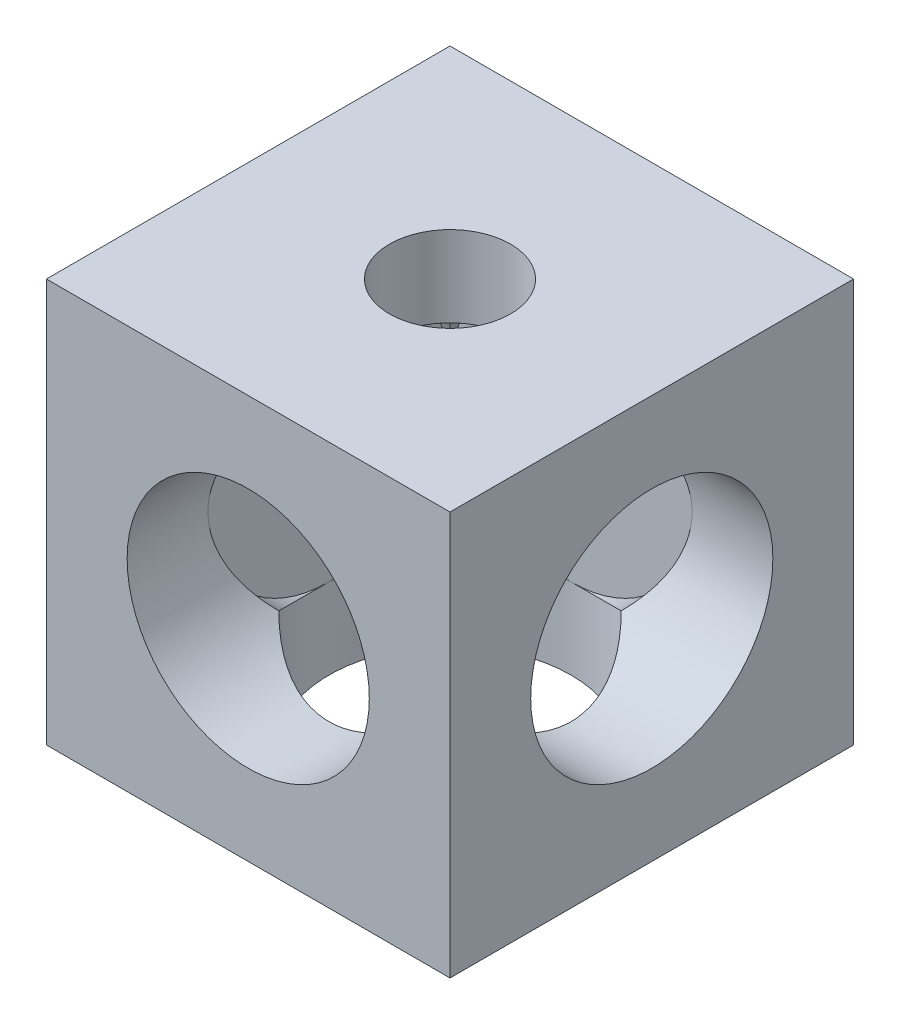
ISO-10303-21;
HEADER;
FILE_DESCRIPTION(('STEP AP214'),'2;1');
FILE_NAME('part.step','',(''),(''),'','','');
FILE_SCHEMA(('AUTOMOTIVE_DESIGN { 1 0 10303 214 1 1 1 1 }'));
ENDSEC;
DATA;
#1=APPLICATION_CONTEXT('core data for automotive mechanical design processes');
#2=APPLICATION_PROTOCOL_DEFINITION('international standard','automotive_design',2000,#1);
#3=PRODUCT_CONTEXT('',#1,'mechanical');
#4=PRODUCT('Part','Part','',(#3));
#5=PRODUCT_RELATED_PRODUCT_CATEGORY('part','',(#4));
#6=PRODUCT_DEFINITION_FORMATION('','',#4);
#7=PRODUCT_DEFINITION_CONTEXT('part definition',#1,'design');
#8=PRODUCT_DEFINITION('design','',#6,#7);
#9=PRODUCT_DEFINITION_SHAPE('','',#8);
#10=(LENGTH_UNIT() NAMED_UNIT(*) SI_UNIT(.MILLI.,.METRE.));
#11=(NAMED_UNIT(*) PLANE_ANGLE_UNIT() SI_UNIT($,.RADIAN.));
#12=(NAMED_UNIT(*) SI_UNIT($,.STERADIAN.) SOLID_ANGLE_UNIT());
#13=UNCERTAINTY_MEASURE_WITH_UNIT(LENGTH_MEASURE(1.E-05),#10,'distance_accuracy_value','');
#14=(GEOMETRIC_REPRESENTATION_CONTEXT(3) GLOBAL_UNCERTAINTY_ASSIGNED_CONTEXT((#13)) GLOBAL_UNIT_ASSIGNED_CONTEXT((#10,
#11,#12)) REPRESENTATION_CONTEXT('',''));
#15=CARTESIAN_POINT('',(0.,0.,0.));
#16=DIRECTION('',(0.,0.,1.));
#17=DIRECTION('',(1.,0.,0.));
#18=AXIS2_PLACEMENT_3D('',#15,#16,#17);
#19=CARTESIAN_POINT('',(5.,5.,2.));
#20=DIRECTION('',(0.,0.,1.));
#21=DIRECTION('',(1.,0.,0.));
#22=AXIS2_PLACEMENT_3D('',#19,#20,#21);
#23=CYLINDRICAL_SURFACE('',#22,3.);
#24=CARTESIAN_POINT('',(5.,5.,2.));
#25=DIRECTION('',(0.,0.,1.));
#26=DIRECTION('',(1.,0.,0.));
#27=AXIS2_PLACEMENT_3D('',#24,#25,#26);
#28=CIRCLE('',#27,3.);
#29=CARTESIAN_POINT('',(5.,8.,2.));
#30=VERTEX_POINT('',#29);
#31=CARTESIAN_POINT('',(2.00000000000001,5.,2.));
#32=VERTEX_POINT('',#31);
#33=EDGE_CURVE('E164',#30,#32,#28,.T.);
#34=ORIENTED_EDGE('',*,*,#33,.F.);
#35=CARTESIAN_POINT('',(5.,5.,5.));
#36=DIRECTION('',(0.,0.707106781186547,0.707106781186547));
#37=DIRECTION('',(0.,-0.707106781186547,0.707106781186547));
#38=AXIS2_PLACEMENT_3D('',#35,#36,#37);
#39=ELLIPSE('',#38,4.24264068711928,3.);
#40=CARTESIAN_POINT('',(2.87867965644036,7.12132034355965,2.87867965644036));
#41=VERTEX_POINT('',#40);
#42=EDGE_CURVE('E127',#30,#41,#39,.T.);
#43=ORIENTED_EDGE('',*,*,#42,.T.);
#44=CARTESIAN_POINT('',(5.,5.,5.));
#45=DIRECTION('',(-0.707106781186547,0.,0.707106781186547));
#46=DIRECTION('',(0.707106781186547,0.,0.707106781186547));
#47=AXIS2_PLACEMENT_3D('',#44,#45,#46);
#48=ELLIPSE('',#47,4.24264068711928,3.);
#49=EDGE_CURVE('E165',#41,#32,#48,.T.);
#50=ORIENTED_EDGE('',*,*,#49,.T.);
#51=EDGE_LOOP('',(#34,#43,#50));
#52=FACE_BOUND('',#51,.T.);
#53=ADVANCED_FACE('F33',(#52),#23,.F.);
#54=CARTESIAN_POINT('',(2.87867965644036,2.87867965644036,2.87867965644036));
#55=VERTEX_POINT('',#54);
#56=EDGE_CURVE('E226',#32,#55,#48,.T.);
#57=ORIENTED_EDGE('',*,*,#56,.T.);
#58=CARTESIAN_POINT('',(5.,5.,5.));
#59=DIRECTION('',(0.,-0.707106781186547,0.707106781186547));
#60=DIRECTION('',(0.,0.707106781186547,0.707106781186547));
#61=AXIS2_PLACEMENT_3D('',#58,#59,#60);
#62=ELLIPSE('',#61,4.24264068711928,3.);
#63=CARTESIAN_POINT('',(5.,2.00000000000001,2.));
#64=VERTEX_POINT('',#63);
#65=EDGE_CURVE('E293',#55,#64,#62,.T.);
#66=ORIENTED_EDGE('',*,*,#65,.T.);
#67=EDGE_CURVE('E170',#32,#64,#28,.T.);
#68=ORIENTED_EDGE('',*,*,#67,.F.);
#69=EDGE_LOOP('',(#57,#66,#68));
#70=FACE_BOUND('',#69,.T.);
#71=ADVANCED_FACE('F292',(#70),#23,.F.);
#72=CARTESIAN_POINT('',(2.00000000000001,5.,5.));
#73=DIRECTION('',(1.,0.,0.));
#74=DIRECTION('',(0.,0.,-1.));
#75=AXIS2_PLACEMENT_3D('',#72,#73,#74);
#76=CYLINDRICAL_SURFACE('',#75,3.);
#77=CARTESIAN_POINT('',(5.,5.,5.));
#78=DIRECTION('',(0.707106781186547,0.,0.707106781186547));
#79=DIRECTION('',(-0.707106781186547,0.,0.707106781186547));
#80=AXIS2_PLACEMENT_3D('',#77,#78,#79);
#81=ELLIPSE('',#80,4.24264068711928,3.);
#82=CARTESIAN_POINT('',(2.87867965644036,2.87867965644036,7.12132034355964));
#83=VERTEX_POINT('',#82);
#84=CARTESIAN_POINT('',(2.00000000000001,5.,8.));
#85=VERTEX_POINT('',#84);
#86=EDGE_CURVE('E234',#83,#85,#81,.F.);
#87=ORIENTED_EDGE('',*,*,#86,.F.);
#88=CARTESIAN_POINT('',(5.,5.,5.));
#89=DIRECTION('',(0.707106781186547,-0.707106781186547,0.));
#90=DIRECTION('',(0.707106781186547,0.707106781186547,0.));
#91=AXIS2_PLACEMENT_3D('',#88,#89,#90);
#92=ELLIPSE('',#91,4.24264068711928,3.);
#93=CARTESIAN_POINT('',(2.00000000000001,2.,5.));
#94=VERTEX_POINT('',#93);
#95=EDGE_CURVE('E252',#83,#94,#92,.T.);
#96=ORIENTED_EDGE('',*,*,#95,.T.);
#97=CARTESIAN_POINT('',(2.00000000000001,5.,5.));
#98=DIRECTION('',(1.,0.,0.));
#99=DIRECTION('',(0.,0.,-1.));
#100=AXIS2_PLACEMENT_3D('',#97,#98,#99);
#101=CIRCLE('',#100,3.);
#102=EDGE_CURVE('E268',#85,#94,#101,.T.);
#103=ORIENTED_EDGE('',*,*,#102,.F.);
#104=EDGE_LOOP('',(#87,#96,#103));
#105=FACE_BOUND('',#104,.T.);
#106=ADVANCED_FACE('F284',(#105),#76,.F.);
#107=CARTESIAN_POINT('',(2.,8.,5.));
#108=VERTEX_POINT('',#107);
#109=EDGE_CURVE('E266',#108,#85,#101,.T.);
#110=ORIENTED_EDGE('',*,*,#109,.F.);
#111=CARTESIAN_POINT('',(5.,5.,5.));
#112=DIRECTION('',(0.707106781186547,0.707106781186547,0.));
#113=DIRECTION('',(0.707106781186547,-0.707106781186547,0.));
#114=AXIS2_PLACEMENT_3D('',#111,#112,#113);
#115=ELLIPSE('',#114,4.24264068711928,3.);
#116=CARTESIAN_POINT('',(2.87867965644036,7.12132034355965,7.12132034355964));
#117=VERTEX_POINT('',#116);
#118=EDGE_CURVE('E162',#108,#117,#115,.T.);
#119=ORIENTED_EDGE('',*,*,#118,.T.);
#120=EDGE_CURVE('E231',#85,#117,#81,.F.);
#121=ORIENTED_EDGE('',*,*,#120,.F.);
#122=EDGE_LOOP('',(#110,#119,#121));
#123=FACE_BOUND('',#122,.T.);
#124=ADVANCED_FACE('F282',(#123),#76,.F.);
#125=CARTESIAN_POINT('',(5.,10.,5.));
#126=DIRECTION('',(0.,-1.,0.));
#127=DIRECTION('',(0.,0.,-1.));
#128=AXIS2_PLACEMENT_3D('',#125,#126,#127);
#129=CYLINDRICAL_SURFACE('',#128,1.5);
#130=CARTESIAN_POINT('',(5.,10.,5.));
#131=DIRECTION('',(0.,-1.,0.));
#132=DIRECTION('',(0.,0.,-1.));
#133=AXIS2_PLACEMENT_3D('',#130,#131,#132);
#134=CIRCLE('',#133,1.5);
#135=CARTESIAN_POINT('',(5.,10.,3.5));
#136=VERTEX_POINT('',#135);
#137=EDGE_CURVE('E138',#136,#136,#134,.T.);
#138=ORIENTED_EDGE('',*,*,#137,.F.);
#139=EDGE_LOOP('',(#138));
#140=FACE_BOUND('',#139,.T.);
#141=CARTESIAN_POINT('',(5.,8.,5.));
#142=DIRECTION('',(0.,-1.,0.));
#143=DIRECTION('',(0.,0.,-1.));
#144=AXIS2_PLACEMENT_3D('',#141,#142,#143);
#145=CIRCLE('',#144,1.5);
#146=CARTESIAN_POINT('',(5.,8.,3.5));
#147=VERTEX_POINT('',#146);
#148=EDGE_CURVE('E238',#147,#147,#145,.F.);
#149=ORIENTED_EDGE('',*,*,#148,.F.);
#150=EDGE_LOOP('',(#149));
#151=FACE_BOUND('',#150,.T.);
#152=ADVANCED_FACE('F360',(#140,#151),#129,.F.);
#153=CARTESIAN_POINT('',(5.,5.,5.));
#154=DIRECTION('',(0.707106781186547,0.,0.707106781186547));
#155=DIRECTION('',(-0.707106781186547,0.,0.707106781186547));
#156=AXIS2_PLACEMENT_3D('',#153,#154,#155);
#157=ELLIPSE('',#156,4.24264068711928,3.);
#158=CARTESIAN_POINT('',(8.,5.,2.));
#159=VERTEX_POINT('',#158);
#160=CARTESIAN_POINT('',(7.12132034355965,7.12132034355965,2.87867965644036));
#161=VERTEX_POINT('',#160);
#162=EDGE_CURVE('E161',#159,#161,#157,.T.);
#163=ORIENTED_EDGE('',*,*,#162,.T.);
#164=EDGE_CURVE('E49',#161,#30,#39,.T.);
#165=ORIENTED_EDGE('',*,*,#164,.T.);
#166=EDGE_CURVE('E159',#159,#30,#28,.T.);
#167=ORIENTED_EDGE('',*,*,#166,.F.);
#168=EDGE_LOOP('',(#163,#165,#167));
#169=FACE_BOUND('',#168,.T.);
#170=ADVANCED_FACE('F157',(#169),#23,.F.);
#171=CARTESIAN_POINT('',(5.,5.,10.));
#172=DIRECTION('',(0.,0.,1.));
#173=DIRECTION('',(1.,0.,0.));
#174=AXIS2_PLACEMENT_3D('',#171,#172,#173);
#175=CIRCLE('',#174,3.);
#176=CARTESIAN_POINT('',(8.,5.,10.));
#177=VERTEX_POINT('',#176);
#178=EDGE_CURVE('E183',#177,#177,#175,.T.);
#179=ORIENTED_EDGE('',*,*,#178,.T.);
#180=EDGE_LOOP('',(#179));
#181=FACE_BOUND('',#180,.T.);
#182=ORIENTED_EDGE('',*,*,#120,.T.);
#183=CARTESIAN_POINT('',(5.,5.,5.));
#184=DIRECTION('',(0.,-0.707106781186547,0.707106781186547));
#185=DIRECTION('',(0.,0.707106781186547,0.707106781186547));
#186=AXIS2_PLACEMENT_3D('',#183,#184,#185);
#187=ELLIPSE('',#186,4.24264068711928,3.);
#188=CARTESIAN_POINT('',(5.,8.,8.));
#189=VERTEX_POINT('',#188);
#190=EDGE_CURVE('E163',#117,#189,#187,.F.);
#191=ORIENTED_EDGE('',*,*,#190,.T.);
#192=CARTESIAN_POINT('',(7.12132034355965,7.12132034355965,7.12132034355964));
#193=VERTEX_POINT('',#192);
#194=EDGE_CURVE('E250',#189,#193,#187,.F.);
#195=ORIENTED_EDGE('',*,*,#194,.T.);
#196=CARTESIAN_POINT('',(5.,5.,5.));
#197=DIRECTION('',(-0.707106781186547,0.,0.707106781186547));
#198=DIRECTION('',(0.707106781186547,0.,0.707106781186547));
#199=AXIS2_PLACEMENT_3D('',#196,#197,#198);
#200=ELLIPSE('',#199,4.24264068711928,3.);
#201=CARTESIAN_POINT('',(7.12132034355965,2.87867965644036,7.12132034355964));
#202=VERTEX_POINT('',#201);
#203=EDGE_CURVE('E235',#193,#202,#200,.F.);
#204=ORIENTED_EDGE('',*,*,#203,.T.);
#205=CARTESIAN_POINT('',(5.,5.,5.));
#206=DIRECTION('',(0.,0.707106781186547,0.707106781186547));
#207=DIRECTION('',(0.,-0.707106781186547,0.707106781186547));
#208=AXIS2_PLACEMENT_3D('',#205,#206,#207);
#209=ELLIPSE('',#208,4.24264068711928,3.);
#210=EDGE_CURVE('E57',#202,#83,#209,.F.);
#211=ORIENTED_EDGE('',*,*,#210,.T.);
#212=ORIENTED_EDGE('',*,*,#86,.T.);
#213=EDGE_LOOP('',(#182,#191,#195,#204,#211,#212));
#214=FACE_BOUND('',#213,.T.);
#215=ADVANCED_FACE('F247',(#181,#214),#23,.F.);
#216=CARTESIAN_POINT('',(0.,5.,5.));
#217=DIRECTION('',(1.,0.,0.));
#218=DIRECTION('',(0.,0.,-1.));
#219=AXIS2_PLACEMENT_3D('',#216,#217,#218);
#220=CYLINDRICAL_SURFACE('',#219,1.5);
#221=CARTESIAN_POINT('',(0.,5.,5.));
#222=DIRECTION('',(1.,0.,0.));
#223=DIRECTION('',(0.,0.,-1.));
#224=AXIS2_PLACEMENT_3D('',#221,#222,#223);
#225=CIRCLE('',#224,1.5);
#226=CARTESIAN_POINT('',(0.,5.,3.5));
#227=VERTEX_POINT('',#226);
#228=EDGE_CURVE('E185',#227,#227,#225,.T.);
#229=ORIENTED_EDGE('',*,*,#228,.F.);
#230=EDGE_LOOP('',(#229));
#231=FACE_BOUND('',#230,.T.);
#232=CARTESIAN_POINT('',(2.00000000000001,5.,5.));
#233=DIRECTION('',(1.,0.,0.));
#234=DIRECTION('',(0.,0.,-1.));
#235=AXIS2_PLACEMENT_3D('',#232,#233,#234);
#236=CIRCLE('',#235,1.5);
#237=CARTESIAN_POINT('',(2.00000000000001,5.,3.5));
#238=VERTEX_POINT('',#237);
#239=EDGE_CURVE('E222',#238,#238,#236,.F.);
#240=ORIENTED_EDGE('',*,*,#239,.F.);
#241=EDGE_LOOP('',(#240));
#242=FACE_BOUND('',#241,.T.);
#243=ADVANCED_FACE('F352',(#231,#242),#220,.F.);
#244=CARTESIAN_POINT('',(5.,5.,0.));
#245=DIRECTION('',(0.,0.,1.));
#246=DIRECTION('',(1.,0.,0.));
#247=AXIS2_PLACEMENT_3D('',#244,#245,#246);
#248=CYLINDRICAL_SURFACE('',#247,1.5);
#249=CARTESIAN_POINT('',(5.,5.,0.));
#250=DIRECTION('',(0.,0.,1.));
#251=DIRECTION('',(1.,0.,0.));
#252=AXIS2_PLACEMENT_3D('',#249,#250,#251);
#253=CIRCLE('',#252,1.5);
#254=CARTESIAN_POINT('',(6.5,5.,0.));
#255=VERTEX_POINT('',#254);
#256=EDGE_CURVE('E178',#255,#255,#253,.T.);
#257=ORIENTED_EDGE('',*,*,#256,.F.);
#258=EDGE_LOOP('',(#257));
#259=FACE_BOUND('',#258,.T.);
#260=CARTESIAN_POINT('',(5.,5.,2.));
#261=DIRECTION('',(0.,0.,1.));
#262=DIRECTION('',(1.,0.,0.));
#263=AXIS2_PLACEMENT_3D('',#260,#261,#262);
#264=CIRCLE('',#263,1.5);
#265=CARTESIAN_POINT('',(6.5,5.,2.));
#266=VERTEX_POINT('',#265);
#267=EDGE_CURVE('E176',#266,#266,#264,.F.);
#268=ORIENTED_EDGE('',*,*,#267,.F.);
#269=EDGE_LOOP('',(#268));
#270=FACE_BOUND('',#269,.T.);
#271=ADVANCED_FACE('F357',(#259,#270),#248,.F.);
#272=CARTESIAN_POINT('',(0.,0.,10.));
#273=DIRECTION('',(1.,0.,0.));
#274=DIRECTION('',(0.,0.,-1.));
#275=AXIS2_PLACEMENT_3D('',#272,#273,#274);
#276=PLANE('',#275);
#277=ORIENTED_EDGE('',*,*,#228,.T.);
#278=EDGE_LOOP('',(#277));
#279=FACE_BOUND('',#278,.T.);
#280=DIRECTION('',(0.,-1.,0.));
#281=VECTOR('',#280,1.);
#282=CARTESIAN_POINT('',(0.,0.,0.));
#283=LINE('',#282,#281);
#284=CARTESIAN_POINT('',(0.,10.,0.));
#285=VERTEX_POINT('',#284);
#286=CARTESIAN_POINT('',(0.,0.,0.));
#287=VERTEX_POINT('',#286);
#288=EDGE_CURVE('E193',#285,#287,#283,.T.);
#289=ORIENTED_EDGE('',*,*,#288,.T.);
#290=DIRECTION('',(0.,0.,-1.));
#291=VECTOR('',#290,1.);
#292=CARTESIAN_POINT('',(0.,0.,10.));
#293=LINE('',#292,#291);
#294=CARTESIAN_POINT('',(0.,0.,10.));
#295=VERTEX_POINT('',#294);
#296=EDGE_CURVE('E220',#295,#287,#293,.T.);
#297=ORIENTED_EDGE('',*,*,#296,.F.);
#298=DIRECTION('',(0.,-1.,0.));
#299=VECTOR('',#298,1.);
#300=CARTESIAN_POINT('',(0.,0.,10.));
#301=LINE('',#300,#299);
#302=CARTESIAN_POINT('',(0.,10.,10.));
#303=VERTEX_POINT('',#302);
#304=EDGE_CURVE('E194',#303,#295,#301,.T.);
#305=ORIENTED_EDGE('',*,*,#304,.F.);
#306=DIRECTION('',(0.,0.,-1.));
#307=VECTOR('',#306,1.);
#308=CARTESIAN_POINT('',(0.,10.,10.));
#309=LINE('',#308,#307);
#310=EDGE_CURVE('E204',#303,#285,#309,.T.);
#311=ORIENTED_EDGE('',*,*,#310,.T.);
#312=EDGE_LOOP('',(#289,#297,#305,#311));
#313=FACE_BOUND('',#312,.T.);
#314=ADVANCED_FACE('F35',(#279,#313),#276,.F.);
#315=CARTESIAN_POINT('',(0.,0.,10.));
#316=DIRECTION('',(0.,1.,0.));
#317=DIRECTION('',(0.,0.,1.));
#318=AXIS2_PLACEMENT_3D('',#315,#316,#317);
#319=PLANE('',#318);
#320=CARTESIAN_POINT('',(5.,0.,5.));
#321=DIRECTION('',(0.,-1.,0.));
#322=DIRECTION('',(0.,0.,-1.));
#323=AXIS2_PLACEMENT_3D('',#320,#321,#322);
#324=CIRCLE('',#323,3.);
#325=CARTESIAN_POINT('',(5.,0.,2.));
#326=VERTEX_POINT('',#325);
#327=EDGE_CURVE('E148',#326,#326,#324,.T.);
#328=ORIENTED_EDGE('',*,*,#327,.F.);
#329=EDGE_LOOP('',(#328));
#330=FACE_BOUND('',#329,.T.);
#331=DIRECTION('',(1.,0.,0.));
#332=VECTOR('',#331,1.);
#333=CARTESIAN_POINT('',(0.,0.,0.));
#334=LINE('',#333,#332);
#335=CARTESIAN_POINT('',(10.,0.,0.));
#336=VERTEX_POINT('',#335);
#337=EDGE_CURVE('E207',#287,#336,#334,.T.);
#338=ORIENTED_EDGE('',*,*,#337,.T.);
#339=DIRECTION('',(0.,0.,-1.));
#340=VECTOR('',#339,1.);
#341=CARTESIAN_POINT('',(10.,0.,10.));
#342=LINE('',#341,#340);
#343=CARTESIAN_POINT('',(10.,0.,10.));
#344=VERTEX_POINT('',#343);
#345=EDGE_CURVE('E217',#344,#336,#342,.T.);
#346=ORIENTED_EDGE('',*,*,#345,.F.);
#347=DIRECTION('',(1.,0.,0.));
#348=VECTOR('',#347,1.);
#349=CARTESIAN_POINT('',(0.,0.,10.));
#350=LINE('',#349,#348);
#351=EDGE_CURVE('E197',#295,#344,#350,.T.);
#352=ORIENTED_EDGE('',*,*,#351,.F.);
#353=ORIENTED_EDGE('',*,*,#296,.T.);
#354=EDGE_LOOP('',(#338,#346,#352,#353));
#355=FACE_BOUND('',#354,.T.);
#356=ADVANCED_FACE('F303',(#330,#355),#319,.F.);
#357=CARTESIAN_POINT('',(10.,0.,10.));
#358=DIRECTION('',(-1.,0.,0.));
#359=DIRECTION('',(0.,0.,1.));
#360=AXIS2_PLACEMENT_3D('',#357,#358,#359);
#361=PLANE('',#360);
#362=CARTESIAN_POINT('',(10.,5.,5.));
#363=DIRECTION('',(1.,0.,0.));
#364=DIRECTION('',(0.,0.,-1.));
#365=AXIS2_PLACEMENT_3D('',#362,#363,#364);
#366=CIRCLE('',#365,3.);
#367=CARTESIAN_POINT('',(10.,5.,2.));
#368=VERTEX_POINT('',#367);
#369=EDGE_CURVE('E263',#368,#368,#366,.T.);
#370=ORIENTED_EDGE('',*,*,#369,.F.);
#371=EDGE_LOOP('',(#370));
#372=FACE_BOUND('',#371,.T.);
#373=DIRECTION('',(0.,1.,0.));
#374=VECTOR('',#373,1.);
#375=CARTESIAN_POINT('',(10.,0.,0.));
#376=LINE('',#375,#374);
#377=CARTESIAN_POINT('',(10.,10.,0.));
#378=VERTEX_POINT('',#377);
#379=EDGE_CURVE('E209',#336,#378,#376,.T.);
#380=ORIENTED_EDGE('',*,*,#379,.T.);
#381=DIRECTION('',(0.,0.,-1.));
#382=VECTOR('',#381,1.);
#383=CARTESIAN_POINT('',(10.,10.,10.));
#384=LINE('',#383,#382);
#385=CARTESIAN_POINT('',(10.,10.,10.));
#386=VERTEX_POINT('',#385);
#387=EDGE_CURVE('E214',#386,#378,#384,.T.);
#388=ORIENTED_EDGE('',*,*,#387,.F.);
#389=DIRECTION('',(0.,1.,0.));
#390=VECTOR('',#389,1.);
#391=CARTESIAN_POINT('',(10.,0.,10.));
#392=LINE('',#391,#390);
#393=EDGE_CURVE('E200',#344,#386,#392,.T.);
#394=ORIENTED_EDGE('',*,*,#393,.F.);
#395=ORIENTED_EDGE('',*,*,#345,.T.);
#396=EDGE_LOOP('',(#380,#388,#394,#395));
#397=FACE_BOUND('',#396,.T.);
#398=ADVANCED_FACE('F306',(#372,#397),#361,.F.);
#399=CARTESIAN_POINT('',(0.,10.,10.));
#400=DIRECTION('',(0.,-1.,0.));
#401=DIRECTION('',(0.,0.,-1.));
#402=AXIS2_PLACEMENT_3D('',#399,#400,#401);
#403=PLANE('',#402);
#404=ORIENTED_EDGE('',*,*,#137,.T.);
#405=EDGE_LOOP('',(#404));
#406=FACE_BOUND('',#405,.T.);
#407=DIRECTION('',(-1.,0.,0.));
#408=VECTOR('',#407,1.);
#409=CARTESIAN_POINT('',(0.,10.,0.));
#410=LINE('',#409,#408);
#411=EDGE_CURVE('E198',#378,#285,#410,.T.);
#412=ORIENTED_EDGE('',*,*,#411,.T.);
#413=ORIENTED_EDGE('',*,*,#310,.F.);
#414=DIRECTION('',(-1.,0.,0.));
#415=VECTOR('',#414,1.);
#416=CARTESIAN_POINT('',(0.,10.,10.));
#417=LINE('',#416,#415);
#418=EDGE_CURVE('E202',#386,#303,#417,.T.);
#419=ORIENTED_EDGE('',*,*,#418,.F.);
#420=ORIENTED_EDGE('',*,*,#387,.T.);
#421=EDGE_LOOP('',(#412,#413,#419,#420));
#422=FACE_BOUND('',#421,.T.);
#423=ADVANCED_FACE('F319',(#406,#422),#403,.F.);
#424=CARTESIAN_POINT('',(0.,0.,10.));
#425=DIRECTION('',(0.,0.,-1.));
#426=DIRECTION('',(-1.,0.,0.));
#427=AXIS2_PLACEMENT_3D('',#424,#425,#426);
#428=PLANE('',#427);
#429=ORIENTED_EDGE('',*,*,#178,.F.);
#430=EDGE_LOOP('',(#429));
#431=FACE_BOUND('',#430,.T.);
#432=ORIENTED_EDGE('',*,*,#304,.T.);
#433=ORIENTED_EDGE('',*,*,#351,.T.);
#434=ORIENTED_EDGE('',*,*,#393,.T.);
#435=ORIENTED_EDGE('',*,*,#418,.T.);
#436=EDGE_LOOP('',(#432,#433,#434,#435));
#437=FACE_BOUND('',#436,.T.);
#438=ADVANCED_FACE('F324',(#431,#437),#428,.F.);
#439=CARTESIAN_POINT('',(0.,0.,0.));
#440=DIRECTION('',(0.,0.,-1.));
#441=DIRECTION('',(-1.,0.,0.));
#442=AXIS2_PLACEMENT_3D('',#439,#440,#441);
#443=PLANE('',#442);
#444=ORIENTED_EDGE('',*,*,#256,.T.);
#445=EDGE_LOOP('',(#444));
#446=FACE_BOUND('',#445,.T.);
#447=ORIENTED_EDGE('',*,*,#288,.F.);
#448=ORIENTED_EDGE('',*,*,#411,.F.);
#449=ORIENTED_EDGE('',*,*,#379,.F.);
#450=ORIENTED_EDGE('',*,*,#337,.F.);
#451=EDGE_LOOP('',(#447,#448,#449,#450));
#452=FACE_BOUND('',#451,.T.);
#453=ADVANCED_FACE('F316',(#446,#452),#443,.T.);
#454=CARTESIAN_POINT('',(5.,5.,2.));
#455=DIRECTION('',(0.,0.,1.));
#456=DIRECTION('',(1.,0.,0.));
#457=AXIS2_PLACEMENT_3D('',#454,#455,#456);
#458=PLANE('',#457);
#459=ORIENTED_EDGE('',*,*,#267,.T.);
#460=EDGE_LOOP('',(#459));
#461=FACE_BOUND('',#460,.T.);
#462=ORIENTED_EDGE('',*,*,#166,.T.);
#463=ORIENTED_EDGE('',*,*,#33,.T.);
#464=ORIENTED_EDGE('',*,*,#67,.T.);
#465=EDGE_CURVE('E172',#64,#159,#28,.T.);
#466=ORIENTED_EDGE('',*,*,#465,.T.);
#467=EDGE_LOOP('',(#462,#463,#464,#466));
#468=FACE_BOUND('',#467,.T.);
#469=ADVANCED_FACE('F173',(#461,#468),#458,.T.);
#470=ORIENTED_EDGE('',*,*,#465,.F.);
#471=CARTESIAN_POINT('',(7.12132034355965,2.87867965644036,2.87867965644036));
#472=VERTEX_POINT('',#471);
#473=EDGE_CURVE('E152',#64,#472,#62,.T.);
#474=ORIENTED_EDGE('',*,*,#473,.T.);
#475=EDGE_CURVE('E229',#472,#159,#157,.T.);
#476=ORIENTED_EDGE('',*,*,#475,.T.);
#477=EDGE_LOOP('',(#470,#474,#476));
#478=FACE_BOUND('',#477,.T.);
#479=ADVANCED_FACE('F296',(#478),#23,.F.);
#480=CARTESIAN_POINT('',(2.00000000000001,5.,5.));
#481=DIRECTION('',(1.,0.,0.));
#482=DIRECTION('',(0.,0.,-1.));
#483=AXIS2_PLACEMENT_3D('',#480,#481,#482);
#484=PLANE('',#483);
#485=ORIENTED_EDGE('',*,*,#239,.T.);
#486=EDGE_LOOP('',(#485));
#487=FACE_BOUND('',#486,.T.);
#488=EDGE_CURVE('E189',#32,#108,#101,.T.);
#489=ORIENTED_EDGE('',*,*,#488,.T.);
#490=ORIENTED_EDGE('',*,*,#109,.T.);
#491=ORIENTED_EDGE('',*,*,#102,.T.);
#492=EDGE_CURVE('E267',#94,#32,#101,.T.);
#493=ORIENTED_EDGE('',*,*,#492,.T.);
#494=EDGE_LOOP('',(#489,#490,#491,#493));
#495=FACE_BOUND('',#494,.T.);
#496=ADVANCED_FACE('F278',(#487,#495),#484,.T.);
#497=ORIENTED_EDGE('',*,*,#492,.F.);
#498=EDGE_CURVE('E255',#94,#55,#92,.T.);
#499=ORIENTED_EDGE('',*,*,#498,.T.);
#500=ORIENTED_EDGE('',*,*,#56,.F.);
#501=EDGE_LOOP('',(#497,#499,#500));
#502=FACE_BOUND('',#501,.T.);
#503=ADVANCED_FACE('F287',(#502),#76,.F.);
#504=ORIENTED_EDGE('',*,*,#49,.F.);
#505=EDGE_CURVE('E133',#41,#108,#115,.T.);
#506=ORIENTED_EDGE('',*,*,#505,.T.);
#507=ORIENTED_EDGE('',*,*,#488,.F.);
#508=EDGE_LOOP('',(#504,#506,#507));
#509=FACE_BOUND('',#508,.T.);
#510=ADVANCED_FACE('F291',(#509),#76,.F.);
#511=ORIENTED_EDGE('',*,*,#369,.T.);
#512=EDGE_LOOP('',(#511));
#513=FACE_BOUND('',#512,.T.);
#514=ORIENTED_EDGE('',*,*,#203,.F.);
#515=CARTESIAN_POINT('',(5.,5.,5.));
#516=DIRECTION('',(0.707106781186547,-0.707106781186547,0.));
#517=DIRECTION('',(0.707106781186547,0.707106781186547,0.));
#518=AXIS2_PLACEMENT_3D('',#515,#516,#517);
#519=ELLIPSE('',#518,4.24264068711928,3.);
#520=CARTESIAN_POINT('',(8.,8.,5.));
#521=VERTEX_POINT('',#520);
#522=EDGE_CURVE('E11',#193,#521,#519,.F.);
#523=ORIENTED_EDGE('',*,*,#522,.T.);
#524=EDGE_CURVE('E42',#521,#161,#519,.F.);
#525=ORIENTED_EDGE('',*,*,#524,.T.);
#526=ORIENTED_EDGE('',*,*,#162,.F.);
#527=ORIENTED_EDGE('',*,*,#475,.F.);
#528=CARTESIAN_POINT('',(5.,5.,5.));
#529=DIRECTION('',(0.707106781186547,0.707106781186547,0.));
#530=DIRECTION('',(0.707106781186547,-0.707106781186547,0.));
#531=AXIS2_PLACEMENT_3D('',#528,#529,#530);
#532=ELLIPSE('',#531,4.24264068711928,3.);
#533=EDGE_CURVE('E37',#472,#202,#532,.F.);
#534=ORIENTED_EDGE('',*,*,#533,.T.);
#535=EDGE_LOOP('',(#514,#523,#525,#526,#527,#534));
#536=FACE_BOUND('',#535,.T.);
#537=ADVANCED_FACE('F243',(#513,#536),#76,.F.);
#538=CARTESIAN_POINT('',(5.,8.,5.));
#539=DIRECTION('',(0.,-1.,0.));
#540=DIRECTION('',(0.,0.,-1.));
#541=AXIS2_PLACEMENT_3D('',#538,#539,#540);
#542=PLANE('',#541);
#543=CARTESIAN_POINT('',(5.,8.,5.));
#544=DIRECTION('',(0.,-1.,0.));
#545=DIRECTION('',(0.,0.,-1.));
#546=AXIS2_PLACEMENT_3D('',#543,#544,#545);
#547=CIRCLE('',#546,3.);
#548=EDGE_CURVE('E130',#108,#30,#547,.T.);
#549=ORIENTED_EDGE('',*,*,#548,.T.);
#550=EDGE_CURVE('E145',#30,#521,#547,.T.);
#551=ORIENTED_EDGE('',*,*,#550,.T.);
#552=EDGE_CURVE('E153',#521,#189,#547,.T.);
#553=ORIENTED_EDGE('',*,*,#552,.T.);
#554=EDGE_CURVE('E147',#189,#108,#547,.T.);
#555=ORIENTED_EDGE('',*,*,#554,.T.);
#556=EDGE_LOOP('',(#549,#551,#553,#555));
#557=FACE_BOUND('',#556,.T.);
#558=ORIENTED_EDGE('',*,*,#148,.T.);
#559=EDGE_LOOP('',(#558));
#560=FACE_BOUND('',#559,.T.);
#561=ADVANCED_FACE('F142',(#557,#560),#542,.T.);
#562=CARTESIAN_POINT('',(5.,8.,5.));
#563=DIRECTION('',(0.,-1.,0.));
#564=DIRECTION('',(0.,0.,-1.));
#565=AXIS2_PLACEMENT_3D('',#562,#563,#564);
#566=CYLINDRICAL_SURFACE('',#565,3.);
#567=ORIENTED_EDGE('',*,*,#524,.F.);
#568=ORIENTED_EDGE('',*,*,#550,.F.);
#569=ORIENTED_EDGE('',*,*,#164,.F.);
#570=EDGE_LOOP('',(#567,#568,#569));
#571=FACE_BOUND('',#570,.T.);
#572=ADVANCED_FACE('F150',(#571),#566,.F.);
#573=ORIENTED_EDGE('',*,*,#552,.F.);
#574=ORIENTED_EDGE('',*,*,#522,.F.);
#575=ORIENTED_EDGE('',*,*,#194,.F.);
#576=EDGE_LOOP('',(#573,#574,#575));
#577=FACE_BOUND('',#576,.T.);
#578=ADVANCED_FACE('F474',(#577),#566,.F.);
#579=ORIENTED_EDGE('',*,*,#554,.F.);
#580=ORIENTED_EDGE('',*,*,#190,.F.);
#581=ORIENTED_EDGE('',*,*,#118,.F.);
#582=EDGE_LOOP('',(#579,#580,#581));
#583=FACE_BOUND('',#582,.T.);
#584=ADVANCED_FACE('F475',(#583),#566,.F.);
#585=ORIENTED_EDGE('',*,*,#548,.F.);
#586=ORIENTED_EDGE('',*,*,#505,.F.);
#587=ORIENTED_EDGE('',*,*,#42,.F.);
#588=EDGE_LOOP('',(#585,#586,#587));
#589=FACE_BOUND('',#588,.T.);
#590=ADVANCED_FACE('F129',(#589),#566,.F.);
#591=ORIENTED_EDGE('',*,*,#327,.T.);
#592=EDGE_LOOP('',(#591));
#593=FACE_BOUND('',#592,.T.);
#594=ORIENTED_EDGE('',*,*,#210,.F.);
#595=ORIENTED_EDGE('',*,*,#533,.F.);
#596=ORIENTED_EDGE('',*,*,#473,.F.);
#597=ORIENTED_EDGE('',*,*,#65,.F.);
#598=ORIENTED_EDGE('',*,*,#498,.F.);
#599=ORIENTED_EDGE('',*,*,#95,.F.);
#600=EDGE_LOOP('',(#594,#595,#596,#597,#598,#599));
#601=FACE_BOUND('',#600,.T.);
#602=ADVANCED_FACE('F301',(#593,#601),#566,.F.);
#603=CLOSED_SHELL('',(#53,#71,#106,#124,#152,#170,#215,#243,#271,#314,#356,#398,#423,#438,#453,
#469,#479,#496,#503,#510,#537,#561,#572,#578,#584,#590,#602));
#604=MANIFOLD_SOLID_BREP('B2',#603);
#605=ADVANCED_BREP_SHAPE_REPRESENTATION('',(#18,#604),#14);
#606=SHAPE_DEFINITION_REPRESENTATION(#9,#605);
ENDSEC;
END-ISO-10303-21;
